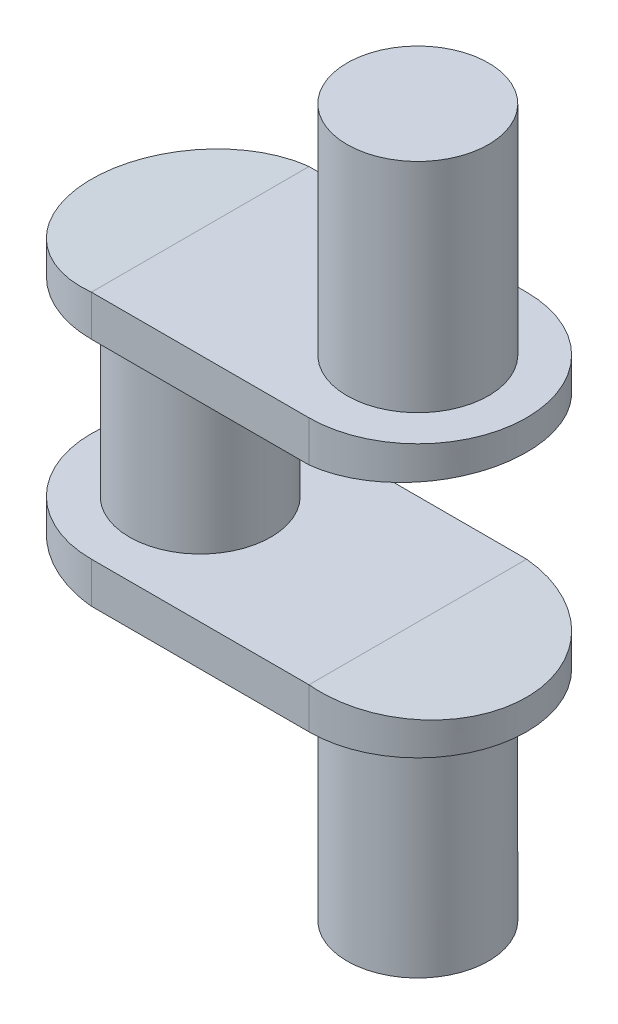
ISO-10303-21;
HEADER;
FILE_DESCRIPTION(('STEP AP214'),'2;1');
FILE_NAME('part.step','',(''),(''),'','','');
FILE_SCHEMA(('AUTOMOTIVE_DESIGN { 1 0 10303 214 1 1 1 1 }'));
ENDSEC;
DATA;
#1=APPLICATION_CONTEXT('core data for automotive mechanical design processes');
#2=APPLICATION_PROTOCOL_DEFINITION('international standard','automotive_design',2000,#1);
#3=PRODUCT_CONTEXT('',#1,'mechanical');
#4=PRODUCT('Part','Part','',(#3));
#5=PRODUCT_RELATED_PRODUCT_CATEGORY('part','',(#4));
#6=PRODUCT_DEFINITION_FORMATION('','',#4);
#7=PRODUCT_DEFINITION_CONTEXT('part definition',#1,'design');
#8=PRODUCT_DEFINITION('design','',#6,#7);
#9=PRODUCT_DEFINITION_SHAPE('','',#8);
#10=(LENGTH_UNIT() NAMED_UNIT(*) SI_UNIT(.MILLI.,.METRE.));
#11=(NAMED_UNIT(*) PLANE_ANGLE_UNIT() SI_UNIT($,.RADIAN.));
#12=(NAMED_UNIT(*) SI_UNIT($,.STERADIAN.) SOLID_ANGLE_UNIT());
#13=UNCERTAINTY_MEASURE_WITH_UNIT(LENGTH_MEASURE(1.E-05),#10,'distance_accuracy_value','');
#14=(GEOMETRIC_REPRESENTATION_CONTEXT(3) GLOBAL_UNCERTAINTY_ASSIGNED_CONTEXT((#13)) GLOBAL_UNIT_ASSIGNED_CONTEXT((#10,
#11,#12)) REPRESENTATION_CONTEXT('',''));
#15=CARTESIAN_POINT('',(0.,0.,0.));
#16=DIRECTION('',(0.,0.,1.));
#17=DIRECTION('',(1.,0.,0.));
#18=AXIS2_PLACEMENT_3D('',#15,#16,#17);
#19=CARTESIAN_POINT('',(0.,35.,0.));
#20=DIRECTION('',(0.,-1.,0.));
#21=DIRECTION('',(0.,0.,-1.));
#22=AXIS2_PLACEMENT_3D('',#19,#20,#21);
#23=CYLINDRICAL_SURFACE('',#22,26.);
#24=CARTESIAN_POINT('',(0.,35.,0.));
#25=DIRECTION('',(0.,1.,0.));
#26=DIRECTION('',(0.,0.,1.));
#27=AXIS2_PLACEMENT_3D('',#24,#25,#26);
#28=CIRCLE('',#27,26.);
#29=CARTESIAN_POINT('',(0.,35.,26.));
#30=VERTEX_POINT('',#29);
#31=EDGE_CURVE('E48',#30,#30,#28,.T.);
#32=ORIENTED_EDGE('',*,*,#31,.F.);
#33=EDGE_LOOP('',(#32));
#34=FACE_BOUND('',#33,.T.);
#35=CARTESIAN_POINT('',(0.,-35.,0.));
#36=DIRECTION('',(0.,1.,0.));
#37=DIRECTION('',(0.,0.,1.));
#38=AXIS2_PLACEMENT_3D('',#35,#36,#37);
#39=CIRCLE('',#38,26.);
#40=CARTESIAN_POINT('',(0.,-35.,26.));
#41=VERTEX_POINT('',#40);
#42=EDGE_CURVE('E151',#41,#41,#39,.T.);
#43=ORIENTED_EDGE('',*,*,#42,.T.);
#44=EDGE_LOOP('',(#43));
#45=FACE_BOUND('',#44,.T.);
#46=ADVANCED_FACE('F39',(#34,#45),#23,.T.);
#47=CARTESIAN_POINT('',(0.,-50.,0.));
#48=DIRECTION('',(0.,1.,0.));
#49=DIRECTION('',(0.,0.,1.));
#50=AXIS2_PLACEMENT_3D('',#47,#48,#49);
#51=CYLINDRICAL_SURFACE('',#50,40.);
#52=CARTESIAN_POINT('',(0.,-50.,0.));
#53=DIRECTION('',(0.099503719020999,0.995037190209989,0.));
#54=DIRECTION('',(-0.995037190209989,0.099503719020999,0.));
#55=AXIS2_PLACEMENT_3D('',#52,#53,#54);
#56=ELLIPSE('',#55,40.1995024844836,40.);
#57=CARTESIAN_POINT('',(0.,-50.,-40.));
#58=VERTEX_POINT('',#57);
#59=CARTESIAN_POINT('',(0.,-50.,40.));
#60=VERTEX_POINT('',#59);
#61=EDGE_CURVE('E83',#58,#60,#56,.T.);
#62=ORIENTED_EDGE('',*,*,#61,.T.);
#63=DIRECTION('',(0.,1.,0.));
#64=VECTOR('',#63,1.);
#65=CARTESIAN_POINT('',(0.,-50.,40.));
#66=LINE('',#65,#64);
#67=CARTESIAN_POINT('',(0.,-35.,40.));
#68=VERTEX_POINT('',#67);
#69=EDGE_CURVE('E116',#60,#68,#66,.T.);
#70=ORIENTED_EDGE('',*,*,#69,.T.);
#71=CARTESIAN_POINT('',(0.,-35.,0.));
#72=DIRECTION('',(0.,-1.,0.));
#73=DIRECTION('',(0.,0.,-1.));
#74=AXIS2_PLACEMENT_3D('',#71,#72,#73);
#75=CIRCLE('',#74,40.);
#76=CARTESIAN_POINT('',(0.,-35.,-40.));
#77=VERTEX_POINT('',#76);
#78=EDGE_CURVE('E165',#68,#77,#75,.T.);
#79=ORIENTED_EDGE('',*,*,#78,.T.);
#80=DIRECTION('',(0.,1.,0.));
#81=VECTOR('',#80,1.);
#82=CARTESIAN_POINT('',(0.,-50.,-40.));
#83=LINE('',#82,#81);
#84=EDGE_CURVE('E119',#58,#77,#83,.T.);
#85=ORIENTED_EDGE('',*,*,#84,.F.);
#86=EDGE_LOOP('',(#62,#70,#79,#85));
#87=FACE_BOUND('',#86,.T.);
#88=ADVANCED_FACE('F114',(#87),#51,.T.);
#89=CARTESIAN_POINT('',(0.,-50.,-40.));
#90=DIRECTION('',(0.,0.,1.));
#91=DIRECTION('',(1.,0.,0.));
#92=AXIS2_PLACEMENT_3D('',#89,#90,#91);
#93=PLANE('',#92);
#94=DIRECTION('',(1.,0.,0.));
#95=VECTOR('',#94,1.);
#96=CARTESIAN_POINT('',(0.,-35.,-40.));
#97=LINE('',#96,#95);
#98=CARTESIAN_POINT('',(80.,-35.,-40.));
#99=VERTEX_POINT('',#98);
#100=EDGE_CURVE('E168',#77,#99,#97,.T.);
#101=ORIENTED_EDGE('',*,*,#100,.T.);
#102=DIRECTION('',(0.,1.,0.));
#103=VECTOR('',#102,1.);
#104=CARTESIAN_POINT('',(80.,-50.,-40.));
#105=LINE('',#104,#103);
#106=CARTESIAN_POINT('',(80.,-50.,-40.));
#107=VERTEX_POINT('',#106);
#108=EDGE_CURVE('E141',#107,#99,#105,.T.);
#109=ORIENTED_EDGE('',*,*,#108,.F.);
#110=DIRECTION('',(1.,0.,0.));
#111=VECTOR('',#110,1.);
#112=CARTESIAN_POINT('',(0.,-50.,-40.));
#113=LINE('',#112,#111);
#114=EDGE_CURVE('E167',#58,#107,#113,.T.);
#115=ORIENTED_EDGE('',*,*,#114,.F.);
#116=ORIENTED_EDGE('',*,*,#84,.T.);
#117=EDGE_LOOP('',(#101,#109,#115,#116));
#118=FACE_BOUND('',#117,.T.);
#119=ADVANCED_FACE('F247',(#118),#93,.F.);
#120=CARTESIAN_POINT('',(80.,-50.,0.));
#121=DIRECTION('',(0.,1.,0.));
#122=DIRECTION('',(0.,0.,1.));
#123=AXIS2_PLACEMENT_3D('',#120,#121,#122);
#124=CYLINDRICAL_SURFACE('',#123,40.);
#125=ORIENTED_EDGE('',*,*,#108,.T.);
#126=CARTESIAN_POINT('',(80.,-35.,0.));
#127=DIRECTION('',(-0.0995037190209986,-0.995037190209989,0.));
#128=DIRECTION('',(-0.995037190209989,0.0995037190209987,0.));
#129=AXIS2_PLACEMENT_3D('',#126,#127,#128);
#130=ELLIPSE('',#129,40.1995024844836,40.);
#131=CARTESIAN_POINT('',(80.,-35.,40.));
#132=VERTEX_POINT('',#131);
#133=EDGE_CURVE('E70',#99,#132,#130,.T.);
#134=ORIENTED_EDGE('',*,*,#133,.T.);
#135=DIRECTION('',(0.,1.,0.));
#136=VECTOR('',#135,1.);
#137=CARTESIAN_POINT('',(80.,-50.,40.));
#138=LINE('',#137,#136);
#139=CARTESIAN_POINT('',(80.,-50.,40.));
#140=VERTEX_POINT('',#139);
#141=EDGE_CURVE('E138',#140,#132,#138,.T.);
#142=ORIENTED_EDGE('',*,*,#141,.F.);
#143=CARTESIAN_POINT('',(80.,-50.,0.));
#144=DIRECTION('',(0.,-1.,0.));
#145=DIRECTION('',(0.,0.,1.));
#146=AXIS2_PLACEMENT_3D('',#143,#144,#145);
#147=CIRCLE('',#146,40.);
#148=EDGE_CURVE('E56',#107,#140,#147,.T.);
#149=ORIENTED_EDGE('',*,*,#148,.F.);
#150=EDGE_LOOP('',(#125,#134,#142,#149));
#151=FACE_BOUND('',#150,.T.);
#152=ADVANCED_FACE('F246',(#151),#124,.T.);
#153=CARTESIAN_POINT('',(0.,-50.,40.));
#154=DIRECTION('',(0.,0.,-1.));
#155=DIRECTION('',(-1.,0.,0.));
#156=AXIS2_PLACEMENT_3D('',#153,#154,#155);
#157=PLANE('',#156);
#158=DIRECTION('',(-1.,0.,0.));
#159=VECTOR('',#158,1.);
#160=CARTESIAN_POINT('',(0.,-35.,40.));
#161=LINE('',#160,#159);
#162=EDGE_CURVE('E77',#132,#68,#161,.T.);
#163=ORIENTED_EDGE('',*,*,#162,.T.);
#164=ORIENTED_EDGE('',*,*,#69,.F.);
#165=DIRECTION('',(-1.,0.,0.));
#166=VECTOR('',#165,1.);
#167=CARTESIAN_POINT('',(0.,-50.,40.));
#168=LINE('',#167,#166);
#169=EDGE_CURVE('E131',#140,#60,#168,.T.);
#170=ORIENTED_EDGE('',*,*,#169,.F.);
#171=ORIENTED_EDGE('',*,*,#141,.T.);
#172=EDGE_LOOP('',(#163,#164,#170,#171));
#173=FACE_BOUND('',#172,.T.);
#174=ADVANCED_FACE('F136',(#173),#157,.F.);
#175=CARTESIAN_POINT('',(0.,-50.,0.));
#176=DIRECTION('',(0.,-1.,0.));
#177=DIRECTION('',(0.,0.,-1.));
#178=AXIS2_PLACEMENT_3D('',#175,#176,#177);
#179=PLANE('',#178);
#180=DIRECTION('',(0.,0.,1.));
#181=VECTOR('',#180,1.);
#182=CARTESIAN_POINT('',(0.,-50.,-40.));
#183=LINE('',#182,#181);
#184=EDGE_CURVE('E123',#58,#60,#183,.T.);
#185=ORIENTED_EDGE('',*,*,#184,.F.);
#186=ORIENTED_EDGE('',*,*,#114,.T.);
#187=ORIENTED_EDGE('',*,*,#148,.T.);
#188=ORIENTED_EDGE('',*,*,#169,.T.);
#189=EDGE_LOOP('',(#185,#186,#187,#188));
#190=FACE_BOUND('',#189,.T.);
#191=CARTESIAN_POINT('',(80.,-50.,0.));
#192=DIRECTION('',(0.,-1.,0.));
#193=DIRECTION('',(0.,0.,-1.));
#194=AXIS2_PLACEMENT_3D('',#191,#192,#193);
#195=CIRCLE('',#194,26.);
#196=CARTESIAN_POINT('',(80.,-50.,-26.));
#197=VERTEX_POINT('',#196);
#198=EDGE_CURVE('E11',#197,#197,#195,.T.);
#199=ORIENTED_EDGE('',*,*,#198,.F.);
#200=EDGE_LOOP('',(#199));
#201=FACE_BOUND('',#200,.T.);
#202=ADVANCED_FACE('F132',(#190,#201),#179,.T.);
#203=CARTESIAN_POINT('',(0.,-35.,0.));
#204=DIRECTION('',(0.,-1.,0.));
#205=DIRECTION('',(0.,0.,-1.));
#206=AXIS2_PLACEMENT_3D('',#203,#204,#205);
#207=PLANE('',#206);
#208=ORIENTED_EDGE('',*,*,#42,.F.);
#209=EDGE_LOOP('',(#208));
#210=FACE_BOUND('',#209,.T.);
#211=ORIENTED_EDGE('',*,*,#162,.F.);
#212=DIRECTION('',(0.,0.,1.));
#213=VECTOR('',#212,1.);
#214=CARTESIAN_POINT('',(80.,-35.,-40.));
#215=LINE('',#214,#213);
#216=EDGE_CURVE('E128',#99,#132,#215,.T.);
#217=ORIENTED_EDGE('',*,*,#216,.F.);
#218=ORIENTED_EDGE('',*,*,#100,.F.);
#219=ORIENTED_EDGE('',*,*,#78,.F.);
#220=EDGE_LOOP('',(#211,#217,#218,#219));
#221=FACE_BOUND('',#220,.T.);
#222=ADVANCED_FACE('F159',(#210,#221),#207,.F.);
#223=CARTESIAN_POINT('',(0.,50.,0.));
#224=DIRECTION('',(0.,-1.,0.));
#225=DIRECTION('',(0.,0.,-1.));
#226=AXIS2_PLACEMENT_3D('',#223,#224,#225);
#227=CYLINDRICAL_SURFACE('',#226,40.);
#228=CARTESIAN_POINT('',(0.,50.,0.));
#229=DIRECTION('',(0.099503719020999,-0.995037190209989,0.));
#230=DIRECTION('',(-0.995037190209989,-0.099503719020999,0.));
#231=AXIS2_PLACEMENT_3D('',#228,#229,#230);
#232=ELLIPSE('',#231,40.1995024844836,40.);
#233=CARTESIAN_POINT('',(0.,50.,-40.));
#234=VERTEX_POINT('',#233);
#235=CARTESIAN_POINT('',(0.,50.,40.));
#236=VERTEX_POINT('',#235);
#237=EDGE_CURVE('E230',#234,#236,#232,.F.);
#238=ORIENTED_EDGE('',*,*,#237,.F.);
#239=DIRECTION('',(0.,-1.,0.));
#240=VECTOR('',#239,1.);
#241=CARTESIAN_POINT('',(0.,50.,-40.));
#242=LINE('',#241,#240);
#243=CARTESIAN_POINT('',(0.,35.,-40.));
#244=VERTEX_POINT('',#243);
#245=EDGE_CURVE('E190',#234,#244,#242,.T.);
#246=ORIENTED_EDGE('',*,*,#245,.T.);
#247=CARTESIAN_POINT('',(0.,35.,0.));
#248=DIRECTION('',(0.,-1.,0.));
#249=DIRECTION('',(0.,0.,-1.));
#250=AXIS2_PLACEMENT_3D('',#247,#248,#249);
#251=CIRCLE('',#250,40.);
#252=CARTESIAN_POINT('',(0.,35.,40.));
#253=VERTEX_POINT('',#252);
#254=EDGE_CURVE('E203',#253,#244,#251,.T.);
#255=ORIENTED_EDGE('',*,*,#254,.F.);
#256=DIRECTION('',(0.,-1.,0.));
#257=VECTOR('',#256,1.);
#258=CARTESIAN_POINT('',(0.,50.,40.));
#259=LINE('',#258,#257);
#260=EDGE_CURVE('E175',#236,#253,#259,.T.);
#261=ORIENTED_EDGE('',*,*,#260,.F.);
#262=EDGE_LOOP('',(#238,#246,#255,#261));
#263=FACE_BOUND('',#262,.T.);
#264=ADVANCED_FACE('F162',(#263),#227,.T.);
#265=CARTESIAN_POINT('',(0.,50.,40.));
#266=DIRECTION('',(0.,0.,1.));
#267=DIRECTION('',(1.,0.,0.));
#268=AXIS2_PLACEMENT_3D('',#265,#266,#267);
#269=PLANE('',#268);
#270=DIRECTION('',(-1.,0.,0.));
#271=VECTOR('',#270,1.);
#272=CARTESIAN_POINT('',(0.,35.,40.));
#273=LINE('',#272,#271);
#274=CARTESIAN_POINT('',(80.,35.,40.));
#275=VERTEX_POINT('',#274);
#276=EDGE_CURVE('E199',#275,#253,#273,.T.);
#277=ORIENTED_EDGE('',*,*,#276,.F.);
#278=DIRECTION('',(0.,-1.,0.));
#279=VECTOR('',#278,1.);
#280=CARTESIAN_POINT('',(80.,50.,40.));
#281=LINE('',#280,#279);
#282=CARTESIAN_POINT('',(80.,50.,40.));
#283=VERTEX_POINT('',#282);
#284=EDGE_CURVE('E182',#283,#275,#281,.T.);
#285=ORIENTED_EDGE('',*,*,#284,.F.);
#286=DIRECTION('',(-1.,0.,0.));
#287=VECTOR('',#286,1.);
#288=CARTESIAN_POINT('',(0.,50.,40.));
#289=LINE('',#288,#287);
#290=EDGE_CURVE('E198',#283,#236,#289,.T.);
#291=ORIENTED_EDGE('',*,*,#290,.T.);
#292=ORIENTED_EDGE('',*,*,#260,.T.);
#293=EDGE_LOOP('',(#277,#285,#291,#292));
#294=FACE_BOUND('',#293,.T.);
#295=ADVANCED_FACE('F284',(#294),#269,.T.);
#296=CARTESIAN_POINT('',(80.,50.,0.));
#297=DIRECTION('',(0.,-1.,0.));
#298=DIRECTION('',(0.,0.,-1.));
#299=AXIS2_PLACEMENT_3D('',#296,#297,#298);
#300=CYLINDRICAL_SURFACE('',#299,40.);
#301=CARTESIAN_POINT('',(80.,35.,0.));
#302=DIRECTION('',(-0.0995037190209986,0.995037190209989,0.));
#303=DIRECTION('',(-0.995037190209989,-0.0995037190209987,0.));
#304=AXIS2_PLACEMENT_3D('',#301,#302,#303);
#305=ELLIPSE('',#304,40.1995024844836,40.);
#306=CARTESIAN_POINT('',(80.,35.,-40.));
#307=VERTEX_POINT('',#306);
#308=EDGE_CURVE('E127',#307,#275,#305,.F.);
#309=ORIENTED_EDGE('',*,*,#308,.F.);
#310=DIRECTION('',(0.,-1.,0.));
#311=VECTOR('',#310,1.);
#312=CARTESIAN_POINT('',(80.,50.,-40.));
#313=LINE('',#312,#311);
#314=CARTESIAN_POINT('',(80.,50.,-40.));
#315=VERTEX_POINT('',#314);
#316=EDGE_CURVE('E186',#315,#307,#313,.T.);
#317=ORIENTED_EDGE('',*,*,#316,.F.);
#318=CARTESIAN_POINT('',(80.,50.,0.));
#319=DIRECTION('',(0.,-1.,0.));
#320=DIRECTION('',(0.,0.,1.));
#321=AXIS2_PLACEMENT_3D('',#318,#319,#320);
#322=CIRCLE('',#321,40.);
#323=EDGE_CURVE('E211',#315,#283,#322,.T.);
#324=ORIENTED_EDGE('',*,*,#323,.T.);
#325=ORIENTED_EDGE('',*,*,#284,.T.);
#326=EDGE_LOOP('',(#309,#317,#324,#325));
#327=FACE_BOUND('',#326,.T.);
#328=ADVANCED_FACE('F276',(#327),#300,.T.);
#329=CARTESIAN_POINT('',(0.,50.,-40.));
#330=DIRECTION('',(0.,0.,-1.));
#331=DIRECTION('',(-1.,0.,0.));
#332=AXIS2_PLACEMENT_3D('',#329,#330,#331);
#333=PLANE('',#332);
#334=DIRECTION('',(1.,0.,0.));
#335=VECTOR('',#334,1.);
#336=CARTESIAN_POINT('',(0.,35.,-40.));
#337=LINE('',#336,#335);
#338=EDGE_CURVE('E194',#244,#307,#337,.T.);
#339=ORIENTED_EDGE('',*,*,#338,.F.);
#340=ORIENTED_EDGE('',*,*,#245,.F.);
#341=DIRECTION('',(1.,0.,0.));
#342=VECTOR('',#341,1.);
#343=CARTESIAN_POINT('',(0.,50.,-40.));
#344=LINE('',#343,#342);
#345=EDGE_CURVE('E193',#234,#315,#344,.T.);
#346=ORIENTED_EDGE('',*,*,#345,.T.);
#347=ORIENTED_EDGE('',*,*,#316,.T.);
#348=EDGE_LOOP('',(#339,#340,#346,#347));
#349=FACE_BOUND('',#348,.T.);
#350=ADVANCED_FACE('F271',(#349),#333,.T.);
#351=CARTESIAN_POINT('',(0.,50.,0.));
#352=DIRECTION('',(0.,1.,0.));
#353=DIRECTION('',(0.,0.,-1.));
#354=AXIS2_PLACEMENT_3D('',#351,#352,#353);
#355=PLANE('',#354);
#356=DIRECTION('',(0.,0.,1.));
#357=VECTOR('',#356,1.);
#358=CARTESIAN_POINT('',(0.,50.,-40.));
#359=LINE('',#358,#357);
#360=EDGE_CURVE('E235',#234,#236,#359,.T.);
#361=ORIENTED_EDGE('',*,*,#360,.T.);
#362=ORIENTED_EDGE('',*,*,#290,.F.);
#363=ORIENTED_EDGE('',*,*,#323,.F.);
#364=ORIENTED_EDGE('',*,*,#345,.F.);
#365=EDGE_LOOP('',(#361,#362,#363,#364));
#366=FACE_BOUND('',#365,.T.);
#367=CARTESIAN_POINT('',(80.,50.,0.));
#368=DIRECTION('',(0.,1.,0.));
#369=DIRECTION('',(0.,0.,1.));
#370=AXIS2_PLACEMENT_3D('',#367,#368,#369);
#371=CIRCLE('',#370,26.);
#372=CARTESIAN_POINT('',(80.,50.,26.));
#373=VERTEX_POINT('',#372);
#374=EDGE_CURVE('E218',#373,#373,#371,.T.);
#375=ORIENTED_EDGE('',*,*,#374,.F.);
#376=EDGE_LOOP('',(#375));
#377=FACE_BOUND('',#376,.T.);
#378=ADVANCED_FACE('F265',(#366,#377),#355,.T.);
#379=CARTESIAN_POINT('',(0.,35.,0.));
#380=DIRECTION('',(0.,1.,0.));
#381=DIRECTION('',(0.,0.,-1.));
#382=AXIS2_PLACEMENT_3D('',#379,#380,#381);
#383=PLANE('',#382);
#384=ORIENTED_EDGE('',*,*,#31,.T.);
#385=EDGE_LOOP('',(#384));
#386=FACE_BOUND('',#385,.T.);
#387=ORIENTED_EDGE('',*,*,#338,.T.);
#388=DIRECTION('',(0.,0.,1.));
#389=VECTOR('',#388,1.);
#390=CARTESIAN_POINT('',(80.,35.,-40.));
#391=LINE('',#390,#389);
#392=EDGE_CURVE('E239',#307,#275,#391,.T.);
#393=ORIENTED_EDGE('',*,*,#392,.T.);
#394=ORIENTED_EDGE('',*,*,#276,.T.);
#395=ORIENTED_EDGE('',*,*,#254,.T.);
#396=EDGE_LOOP('',(#387,#393,#394,#395));
#397=FACE_BOUND('',#396,.T.);
#398=ADVANCED_FACE('F261',(#386,#397),#383,.F.);
#399=CARTESIAN_POINT('',(80.,130.,0.));
#400=DIRECTION('',(0.,-1.,0.));
#401=DIRECTION('',(0.,0.,-1.));
#402=AXIS2_PLACEMENT_3D('',#399,#400,#401);
#403=CYLINDRICAL_SURFACE('',#402,26.);
#404=CARTESIAN_POINT('',(80.,130.,0.));
#405=DIRECTION('',(0.,1.,0.));
#406=DIRECTION('',(0.,0.,1.));
#407=AXIS2_PLACEMENT_3D('',#404,#405,#406);
#408=CIRCLE('',#407,26.);
#409=CARTESIAN_POINT('',(80.,130.,26.));
#410=VERTEX_POINT('',#409);
#411=EDGE_CURVE('E207',#410,#410,#408,.T.);
#412=ORIENTED_EDGE('',*,*,#411,.F.);
#413=EDGE_LOOP('',(#412));
#414=FACE_BOUND('',#413,.T.);
#415=ORIENTED_EDGE('',*,*,#374,.T.);
#416=EDGE_LOOP('',(#415));
#417=FACE_BOUND('',#416,.T.);
#418=ADVANCED_FACE('F264',(#414,#417),#403,.T.);
#419=CARTESIAN_POINT('',(80.,130.,0.));
#420=DIRECTION('',(0.,1.,0.));
#421=DIRECTION('',(0.,0.,1.));
#422=AXIS2_PLACEMENT_3D('',#419,#420,#421);
#423=PLANE('',#422);
#424=ORIENTED_EDGE('',*,*,#411,.T.);
#425=EDGE_LOOP('',(#424));
#426=FACE_BOUND('',#425,.T.);
#427=ADVANCED_FACE('F306',(#426),#423,.T.);
#428=CARTESIAN_POINT('',(80.,-130.,0.));
#429=DIRECTION('',(0.,1.,0.));
#430=DIRECTION('',(0.,0.,1.));
#431=AXIS2_PLACEMENT_3D('',#428,#429,#430);
#432=CYLINDRICAL_SURFACE('',#431,26.);
#433=CARTESIAN_POINT('',(80.,-130.,0.));
#434=DIRECTION('',(0.,1.,0.));
#435=DIRECTION('',(0.,0.,1.));
#436=AXIS2_PLACEMENT_3D('',#433,#434,#435);
#437=CIRCLE('',#436,26.);
#438=CARTESIAN_POINT('',(80.,-130.,26.));
#439=VERTEX_POINT('',#438);
#440=EDGE_CURVE('E121',#439,#439,#437,.T.);
#441=ORIENTED_EDGE('',*,*,#440,.T.);
#442=EDGE_LOOP('',(#441));
#443=FACE_BOUND('',#442,.T.);
#444=ORIENTED_EDGE('',*,*,#198,.T.);
#445=EDGE_LOOP('',(#444));
#446=FACE_BOUND('',#445,.T.);
#447=ADVANCED_FACE('F302',(#443,#446),#432,.T.);
#448=CARTESIAN_POINT('',(80.,-130.,0.));
#449=DIRECTION('',(0.,-1.,0.));
#450=DIRECTION('',(0.,0.,1.));
#451=AXIS2_PLACEMENT_3D('',#448,#449,#450);
#452=PLANE('',#451);
#453=ORIENTED_EDGE('',*,*,#440,.F.);
#454=EDGE_LOOP('',(#453));
#455=FACE_BOUND('',#454,.T.);
#456=ADVANCED_FACE('F296',(#455),#452,.T.);
#457=CARTESIAN_POINT('',(120.,39.,-40.));
#458=DIRECTION('',(-0.0995037190209986,0.995037190209989,0.));
#459=DIRECTION('',(-0.995037190209989,-0.0995037190209987,0.));
#460=AXIS2_PLACEMENT_3D('',#457,#458,#459);
#461=PLANE('',#460);
#462=ORIENTED_EDGE('',*,*,#308,.T.);
#463=ORIENTED_EDGE('',*,*,#392,.F.);
#464=EDGE_LOOP('',(#462,#463));
#465=FACE_BOUND('',#464,.T.);
#466=ADVANCED_FACE('F289',(#465),#461,.F.);
#467=CARTESIAN_POINT('',(-40.,46.,-40.));
#468=DIRECTION('',(0.099503719020999,-0.995037190209989,0.));
#469=DIRECTION('',(0.995037190209989,0.099503719020999,0.));
#470=AXIS2_PLACEMENT_3D('',#467,#468,#469);
#471=PLANE('',#470);
#472=ORIENTED_EDGE('',*,*,#237,.T.);
#473=ORIENTED_EDGE('',*,*,#360,.F.);
#474=EDGE_LOOP('',(#472,#473));
#475=FACE_BOUND('',#474,.T.);
#476=ADVANCED_FACE('F287',(#475),#471,.F.);
#477=CARTESIAN_POINT('',(120.,-39.,-40.));
#478=DIRECTION('',(-0.0995037190209986,-0.995037190209989,0.));
#479=DIRECTION('',(0.995037190209989,-0.0995037190209987,0.));
#480=AXIS2_PLACEMENT_3D('',#477,#478,#479);
#481=PLANE('',#480);
#482=ORIENTED_EDGE('',*,*,#216,.T.);
#483=ORIENTED_EDGE('',*,*,#133,.F.);
#484=EDGE_LOOP('',(#482,#483));
#485=FACE_BOUND('',#484,.T.);
#486=ADVANCED_FACE('F244',(#485),#481,.F.);
#487=CARTESIAN_POINT('',(-40.,-46.,-40.));
#488=DIRECTION('',(0.099503719020999,0.995037190209989,0.));
#489=DIRECTION('',(-0.995037190209989,0.099503719020999,0.));
#490=AXIS2_PLACEMENT_3D('',#487,#488,#489);
#491=PLANE('',#490);
#492=ORIENTED_EDGE('',*,*,#61,.F.);
#493=ORIENTED_EDGE('',*,*,#184,.T.);
#494=EDGE_LOOP('',(#492,#493));
#495=FACE_BOUND('',#494,.T.);
#496=ADVANCED_FACE('F124',(#495),#491,.F.);
#497=CLOSED_SHELL('',(#46,#88,#119,#152,#174,#202,#222,#264,#295,#328,#350,#378,#398,#418,#427,
#447,#456,#466,#476,#486,#496));
#498=MANIFOLD_SOLID_BREP('B2',#497);
#499=ADVANCED_BREP_SHAPE_REPRESENTATION('',(#18,#498),#14);
#500=SHAPE_DEFINITION_REPRESENTATION(#9,#499);
ENDSEC;
END-ISO-10303-21;
